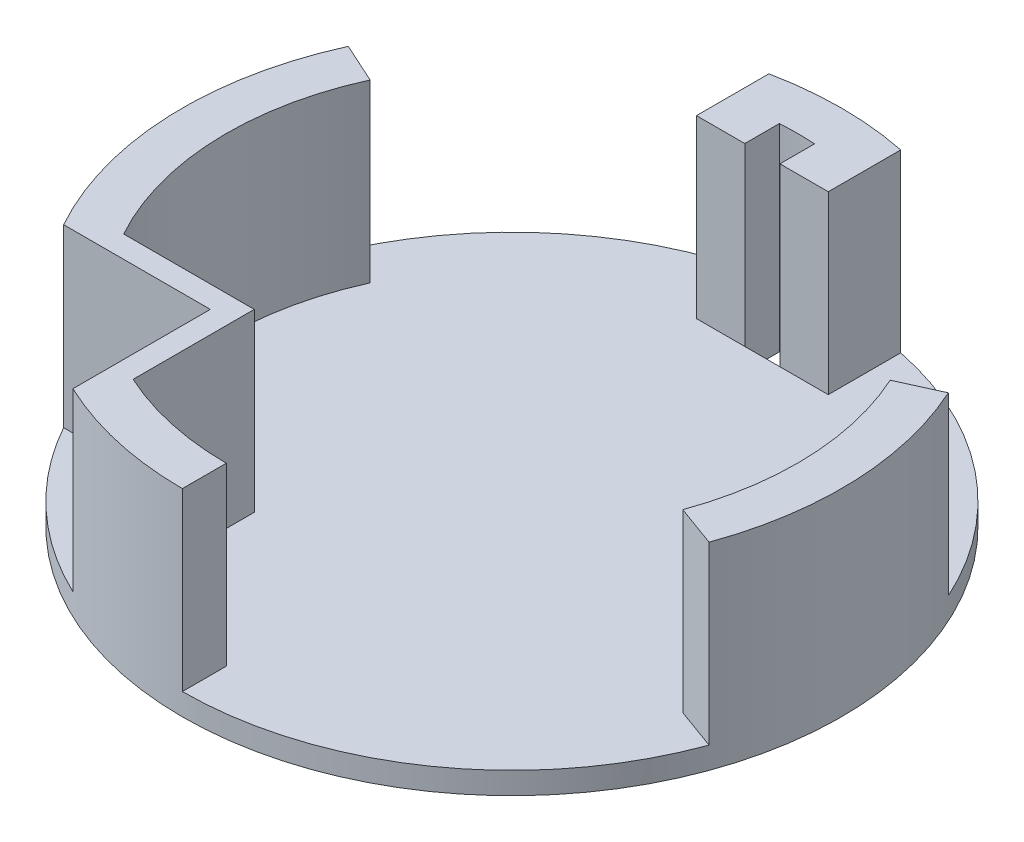
ISO-10303-21;
HEADER;
FILE_DESCRIPTION(('STEP AP214'),'2;1');
FILE_NAME('part.step','',(''),(''),'','','');
FILE_SCHEMA(('AUTOMOTIVE_DESIGN { 1 0 10303 214 1 1 1 1 }'));
ENDSEC;
DATA;
#1=APPLICATION_CONTEXT('core data for automotive mechanical design processes');
#2=APPLICATION_PROTOCOL_DEFINITION('international standard','automotive_design',2000,#1);
#3=PRODUCT_CONTEXT('',#1,'mechanical');
#4=PRODUCT('Part','Part','',(#3));
#5=PRODUCT_RELATED_PRODUCT_CATEGORY('part','',(#4));
#6=PRODUCT_DEFINITION_FORMATION('','',#4);
#7=PRODUCT_DEFINITION_CONTEXT('part definition',#1,'design');
#8=PRODUCT_DEFINITION('design','',#6,#7);
#9=PRODUCT_DEFINITION_SHAPE('','',#8);
#10=(LENGTH_UNIT() NAMED_UNIT(*) SI_UNIT(.MILLI.,.METRE.));
#11=(NAMED_UNIT(*) PLANE_ANGLE_UNIT() SI_UNIT($,.RADIAN.));
#12=(NAMED_UNIT(*) SI_UNIT($,.STERADIAN.) SOLID_ANGLE_UNIT());
#13=UNCERTAINTY_MEASURE_WITH_UNIT(LENGTH_MEASURE(1.E-05),#10,'distance_accuracy_value','');
#14=(GEOMETRIC_REPRESENTATION_CONTEXT(3) GLOBAL_UNCERTAINTY_ASSIGNED_CONTEXT((#13)) GLOBAL_UNIT_ASSIGNED_CONTEXT((#10,
#11,#12)) REPRESENTATION_CONTEXT('',''));
#15=CARTESIAN_POINT('',(0.,0.,0.));
#16=DIRECTION('',(0.,0.,1.));
#17=DIRECTION('',(1.,0.,0.));
#18=AXIS2_PLACEMENT_3D('',#15,#16,#17);
#19=CARTESIAN_POINT('',(-5.93581678931924,5.,0.));
#20=DIRECTION('',(0.,1.,0.));
#21=DIRECTION('',(0.,0.,1.));
#22=AXIS2_PLACEMENT_3D('',#19,#20,#21);
#23=PLANE('',#22);
#24=DIRECTION('',(0.,0.,-1.));
#25=VECTOR('',#24,1.);
#26=CARTESIAN_POINT('',(9.05109394839178,5.,0.));
#27=LINE('',#26,#25);
#28=CARTESIAN_POINT('',(9.05109394839178,5.,-56.9999985956657));
#29=VERTEX_POINT('',#28);
#30=CARTESIAN_POINT('',(9.05109394839178,5.,-73.4873629036985));
#31=VERTEX_POINT('',#30);
#32=EDGE_CURVE('E249',#29,#31,#27,.T.);
#33=ORIENTED_EDGE('',*,*,#32,.F.);
#34=DIRECTION('',(1.,0.,0.));
#35=VECTOR('',#34,1.);
#36=CARTESIAN_POINT('',(0.,5.,-56.9999985956657));
#37=LINE('',#36,#35);
#38=CARTESIAN_POINT('',(-1.94890605160822,5.,-56.9999985956657));
#39=VERTEX_POINT('',#38);
#40=EDGE_CURVE('E246',#39,#29,#37,.T.);
#41=ORIENTED_EDGE('',*,*,#40,.F.);
#42=DIRECTION('',(1.,0.,0.));
#43=VECTOR('',#42,1.);
#44=CARTESIAN_POINT('',(0.,5.,-56.9999985956657));
#45=LINE('',#44,#43);
#46=CARTESIAN_POINT('',(-9.94890605160822,5.,-56.9999985956657));
#47=VERTEX_POINT('',#46);
#48=EDGE_CURVE('E415',#47,#39,#45,.T.);
#49=ORIENTED_EDGE('',*,*,#48,.F.);
#50=DIRECTION('',(1.,0.,0.));
#51=VECTOR('',#50,1.);
#52=CARTESIAN_POINT('',(0.,5.,-56.9999985956657));
#53=LINE('',#52,#51);
#54=CARTESIAN_POINT('',(-20.9489060516082,5.,-56.9999985956657));
#55=VERTEX_POINT('',#54);
#56=EDGE_CURVE('E219',#55,#47,#53,.T.);
#57=ORIENTED_EDGE('',*,*,#56,.F.);
#58=DIRECTION('',(0.,0.,-1.));
#59=VECTOR('',#58,1.);
#60=CARTESIAN_POINT('',(-20.9489060516082,5.,0.));
#61=LINE('',#60,#59);
#62=CARTESIAN_POINT('',(-20.9489060516082,5.,-73.4820192346573));
#63=VERTEX_POINT('',#62);
#64=EDGE_CURVE('E252',#55,#63,#61,.T.);
#65=ORIENTED_EDGE('',*,*,#64,.T.);
#66=CARTESIAN_POINT('',(-5.93581678931924,5.,0.));
#67=DIRECTION('',(0.,1.,0.));
#68=DIRECTION('',(0.,0.,1.));
#69=AXIS2_PLACEMENT_3D('',#66,#67,#68);
#70=CIRCLE('',#69,75.);
#71=CARTESIAN_POINT('',(-74.2133025990146,5.,-31.0352208225888));
#72=VERTEX_POINT('',#71);
#73=EDGE_CURVE('E434',#63,#72,#70,.T.);
#74=ORIENTED_EDGE('',*,*,#73,.T.);
#75=DIRECTION('',(-0.910366477462605,0.,-0.413802944301184));
#76=VECTOR('',#75,1.);
#77=CARTESIAN_POINT('',(-1.01640698447247,5.,2.23609536583944));
#78=LINE('',#77,#76);
#79=CARTESIAN_POINT('',(-65.1096378243886,5.,-26.897191379577));
#80=VERTEX_POINT('',#79);
#81=EDGE_CURVE('E65',#80,#72,#78,.T.);
#82=ORIENTED_EDGE('',*,*,#81,.F.);
#83=CARTESIAN_POINT('',(-5.93581678931925,5.,0.));
#84=DIRECTION('',(0.,1.,0.));
#85=DIRECTION('',(0.,0.,1.));
#86=AXIS2_PLACEMENT_3D('',#83,#84,#85);
#87=CIRCLE('',#86,65.);
#88=CARTESIAN_POINT('',(-62.7930942478822,5.,31.4999999999999));
#89=VERTEX_POINT('',#88);
#90=EDGE_CURVE('E325',#80,#89,#87,.T.);
#91=ORIENTED_EDGE('',*,*,#90,.T.);
#92=DIRECTION('',(-1.,0.,0.));
#93=VECTOR('',#92,1.);
#94=CARTESIAN_POINT('',(0.,5.,31.4999999999999));
#95=LINE('',#94,#93);
#96=CARTESIAN_POINT('',(-33.0722447177623,5.,31.4999999999999));
#97=VERTEX_POINT('',#96);
#98=EDGE_CURVE('E321',#97,#89,#95,.T.);
#99=ORIENTED_EDGE('',*,*,#98,.F.);
#100=DIRECTION('',(0.,0.,1.));
#101=VECTOR('',#100,1.);
#102=CARTESIAN_POINT('',(-33.0722447177623,5.,0.));
#103=LINE('',#102,#101);
#104=CARTESIAN_POINT('',(-33.0722447177623,5.,59.0644925423424));
#105=VERTEX_POINT('',#104);
#106=EDGE_CURVE('E318',#97,#105,#103,.T.);
#107=ORIENTED_EDGE('',*,*,#106,.T.);
#108=CARTESIAN_POINT('',(-5.93581678931925,5.,0.));
#109=DIRECTION('',(0.,1.,0.));
#110=DIRECTION('',(0.,0.,1.));
#111=AXIS2_PLACEMENT_3D('',#108,#109,#110);
#112=CIRCLE('',#111,65.);
#113=CARTESIAN_POINT('',(-5.93581678931924,5.,65.));
#114=VERTEX_POINT('',#113);
#115=EDGE_CURVE('E278',#105,#114,#112,.T.);
#116=ORIENTED_EDGE('',*,*,#115,.T.);
#117=DIRECTION('',(0.,0.,1.));
#118=VECTOR('',#117,1.);
#119=CARTESIAN_POINT('',(-5.93581678931925,5.,0.));
#120=LINE('',#119,#118);
#121=CARTESIAN_POINT('',(-5.93581678931924,5.,75.));
#122=VERTEX_POINT('',#121);
#123=EDGE_CURVE('E284',#114,#122,#120,.T.);
#124=ORIENTED_EDGE('',*,*,#123,.T.);
#125=CARTESIAN_POINT('',(64.5486899723135,5.,25.6307297315028));
#126=VERTEX_POINT('',#125);
#127=EDGE_CURVE('E439',#122,#126,#70,.T.);
#128=ORIENTED_EDGE('',*,*,#127,.T.);
#129=DIRECTION('',(0.939793423488437,0.,0.341743063086705));
#130=VECTOR('',#129,1.);
#131=CARTESIAN_POINT('',(-0.693234077584731,5.,1.90639371335801));
#132=LINE('',#131,#130);
#133=CARTESIAN_POINT('',(55.1507557374292,5.,22.2132991006358));
#134=VERTEX_POINT('',#133);
#135=EDGE_CURVE('E394',#134,#126,#132,.T.);
#136=ORIENTED_EDGE('',*,*,#135,.F.);
#137=CARTESIAN_POINT('',(-5.93581678931925,5.,0.));
#138=DIRECTION('',(0.,1.,0.));
#139=DIRECTION('',(0.,0.,1.));
#140=AXIS2_PLACEMENT_3D('',#137,#138,#139);
#141=CIRCLE('',#140,65.);
#142=CARTESIAN_POINT('',(53.2380042457501,5.,-26.897191379577));
#143=VERTEX_POINT('',#142);
#144=EDGE_CURVE('E375',#134,#143,#141,.T.);
#145=ORIENTED_EDGE('',*,*,#144,.T.);
#146=DIRECTION('',(0.910366477462605,0.,-0.413802944301184));
#147=VECTOR('',#146,1.);
#148=CARTESIAN_POINT('',(-1.01640698447247,5.,-2.23609536583944));
#149=LINE('',#148,#147);
#150=CARTESIAN_POINT('',(62.3416690203761,5.,-31.0352208225888));
#151=VERTEX_POINT('',#150);
#152=EDGE_CURVE('E381',#143,#151,#149,.T.);
#153=ORIENTED_EDGE('',*,*,#152,.T.);
#154=EDGE_CURVE('E429',#151,#31,#70,.T.);
#155=ORIENTED_EDGE('',*,*,#154,.T.);
#156=EDGE_LOOP('',(#33,#41,#49,#57,#65,#74,#82,#91,#99,#107,#116,#124,#128,#136,#145,#153,#155));
#157=FACE_BOUND('',#156,.T.);
#158=ADVANCED_FACE('F41',(#157),#23,.T.);
#159=DIRECTION('',(-1.,0.,0.));
#160=VECTOR('',#159,1.);
#161=CARTESIAN_POINT('',(0.,5.,36.4999999999999));
#162=LINE('',#161,#160);
#163=CARTESIAN_POINT('',(-38.0722447177622,5.,36.4999999999999));
#164=VERTEX_POINT('',#163);
#165=CARTESIAN_POINT('',(-71.4548979794581,5.,36.4999999999999));
#166=VERTEX_POINT('',#165);
#167=EDGE_CURVE('E330',#164,#166,#162,.T.);
#168=ORIENTED_EDGE('',*,*,#167,.T.);
#169=CARTESIAN_POINT('',(-38.0722447177622,5.,67.766141988459));
#170=VERTEX_POINT('',#169);
#171=EDGE_CURVE('E435',#166,#170,#70,.T.);
#172=ORIENTED_EDGE('',*,*,#171,.T.);
#173=DIRECTION('',(0.,0.,1.));
#174=VECTOR('',#173,1.);
#175=CARTESIAN_POINT('',(-38.0722447177622,5.,0.));
#176=LINE('',#175,#174);
#177=EDGE_CURVE('E57',#164,#170,#176,.T.);
#178=ORIENTED_EDGE('',*,*,#177,.F.);
#179=EDGE_LOOP('',(#168,#172,#178));
#180=FACE_BOUND('',#179,.T.);
#181=ADVANCED_FACE('F486',(#180),#23,.T.);
#182=CARTESIAN_POINT('',(-5.93581678931924,0.,0.));
#183=DIRECTION('',(0.,1.,0.));
#184=DIRECTION('',(0.,0.,1.));
#185=AXIS2_PLACEMENT_3D('',#182,#183,#184);
#186=PLANE('',#185);
#187=CARTESIAN_POINT('',(-5.93581678931924,0.,0.));
#188=DIRECTION('',(0.,1.,0.));
#189=DIRECTION('',(0.,0.,1.));
#190=AXIS2_PLACEMENT_3D('',#187,#188,#189);
#191=CIRCLE('',#190,75.);
#192=CARTESIAN_POINT('',(-5.93581678931924,0.,75.));
#193=VERTEX_POINT('',#192);
#194=EDGE_CURVE('E423',#193,#193,#191,.T.);
#195=ORIENTED_EDGE('',*,*,#194,.F.);
#196=EDGE_LOOP('',(#195));
#197=FACE_BOUND('',#196,.T.);
#198=DIRECTION('',(0.,0.,1.));
#199=VECTOR('',#198,1.);
#200=CARTESIAN_POINT('',(-1.94890605160821,0.,0.));
#201=LINE('',#200,#199);
#202=CARTESIAN_POINT('',(-1.94890605160822,0.,-64.8776120304187));
#203=VERTEX_POINT('',#202);
#204=CARTESIAN_POINT('',(-1.94890605160822,0.,-56.9999985956657));
#205=VERTEX_POINT('',#204);
#206=EDGE_CURVE('E11',#203,#205,#201,.T.);
#207=ORIENTED_EDGE('',*,*,#206,.F.);
#208=CARTESIAN_POINT('',(-5.93581678931925,0.,0.));
#209=DIRECTION('',(0.,1.,0.));
#210=DIRECTION('',(0.,0.,1.));
#211=AXIS2_PLACEMENT_3D('',#208,#209,#210);
#212=CIRCLE('',#211,65.);
#213=CARTESIAN_POINT('',(-9.94890605160822,0.,-64.8759979851786));
#214=VERTEX_POINT('',#213);
#215=EDGE_CURVE('E433',#203,#214,#212,.T.);
#216=ORIENTED_EDGE('',*,*,#215,.T.);
#217=DIRECTION('',(0.,0.,1.));
#218=VECTOR('',#217,1.);
#219=CARTESIAN_POINT('',(-9.94890605160819,0.,0.));
#220=LINE('',#219,#218);
#221=CARTESIAN_POINT('',(-9.94890605160822,0.,-56.9999985956657));
#222=VERTEX_POINT('',#221);
#223=EDGE_CURVE('E202',#214,#222,#220,.T.);
#224=ORIENTED_EDGE('',*,*,#223,.T.);
#225=DIRECTION('',(1.,0.,0.));
#226=VECTOR('',#225,1.);
#227=CARTESIAN_POINT('',(-5.93581678931924,0.,-56.9999985956657));
#228=LINE('',#227,#226);
#229=EDGE_CURVE('E50',#222,#205,#228,.T.);
#230=ORIENTED_EDGE('',*,*,#229,.T.);
#231=EDGE_LOOP('',(#207,#216,#224,#230));
#232=FACE_BOUND('',#231,.T.);
#233=ADVANCED_FACE('F447',(#197,#232),#186,.F.);
#234=CARTESIAN_POINT('',(-5.93581678931924,5.,0.));
#235=DIRECTION('',(0.,-1.,0.));
#236=DIRECTION('',(0.,0.,-1.));
#237=AXIS2_PLACEMENT_3D('',#234,#235,#236);
#238=CYLINDRICAL_SURFACE('',#237,75.);
#239=ORIENTED_EDGE('',*,*,#154,.F.);
#240=DIRECTION('',(0.,-1.,0.));
#241=VECTOR('',#240,1.);
#242=CARTESIAN_POINT('',(62.3416690203761,45.,-31.0352208225888));
#243=LINE('',#242,#241);
#244=CARTESIAN_POINT('',(62.3416690203761,45.,-31.0352208225888));
#245=VERTEX_POINT('',#244);
#246=EDGE_CURVE('E403',#245,#151,#243,.T.);
#247=ORIENTED_EDGE('',*,*,#246,.F.);
#248=CARTESIAN_POINT('',(-5.93581678931924,45.,0.));
#249=DIRECTION('',(0.,1.,0.));
#250=DIRECTION('',(0.,0.,1.));
#251=AXIS2_PLACEMENT_3D('',#248,#249,#250);
#252=CIRCLE('',#251,75.);
#253=CARTESIAN_POINT('',(64.5486899723135,45.,25.6307297315028));
#254=VERTEX_POINT('',#253);
#255=EDGE_CURVE('E384',#254,#245,#252,.T.);
#256=ORIENTED_EDGE('',*,*,#255,.F.);
#257=DIRECTION('',(0.,-1.,0.));
#258=VECTOR('',#257,1.);
#259=CARTESIAN_POINT('',(64.5486899723135,45.,25.6307297315028));
#260=LINE('',#259,#258);
#261=EDGE_CURVE('E407',#254,#126,#260,.T.);
#262=ORIENTED_EDGE('',*,*,#261,.T.);
#263=ORIENTED_EDGE('',*,*,#127,.F.);
#264=DIRECTION('',(0.,-1.,0.));
#265=VECTOR('',#264,1.);
#266=CARTESIAN_POINT('',(-5.93581678931924,45.,75.));
#267=LINE('',#266,#265);
#268=CARTESIAN_POINT('',(-5.93581678931924,45.,75.));
#269=VERTEX_POINT('',#268);
#270=EDGE_CURVE('E341',#269,#122,#267,.T.);
#271=ORIENTED_EDGE('',*,*,#270,.F.);
#272=CARTESIAN_POINT('',(-5.93581678931924,45.,0.));
#273=DIRECTION('',(0.,1.,0.));
#274=DIRECTION('',(0.,0.,1.));
#275=AXIS2_PLACEMENT_3D('',#272,#273,#274);
#276=CIRCLE('',#275,75.);
#277=CARTESIAN_POINT('',(-38.0722447177622,45.,67.766141988459));
#278=VERTEX_POINT('',#277);
#279=EDGE_CURVE('E308',#278,#269,#276,.T.);
#280=ORIENTED_EDGE('',*,*,#279,.F.);
#281=DIRECTION('',(0.,-1.,0.));
#282=VECTOR('',#281,1.);
#283=CARTESIAN_POINT('',(-38.0722447177622,45.,67.766141988459));
#284=LINE('',#283,#282);
#285=EDGE_CURVE('E345',#278,#170,#284,.T.);
#286=ORIENTED_EDGE('',*,*,#285,.T.);
#287=ORIENTED_EDGE('',*,*,#171,.F.);
#288=DIRECTION('',(0.,-1.,0.));
#289=VECTOR('',#288,1.);
#290=CARTESIAN_POINT('',(-71.4548979794581,45.,36.4999999999999));
#291=LINE('',#290,#289);
#292=CARTESIAN_POINT('',(-71.4548979794581,45.,36.4999999999999));
#293=VERTEX_POINT('',#292);
#294=EDGE_CURVE('E352',#293,#166,#291,.T.);
#295=ORIENTED_EDGE('',*,*,#294,.F.);
#296=CARTESIAN_POINT('',(-5.93581678931924,45.,0.));
#297=DIRECTION('',(0.,1.,0.));
#298=DIRECTION('',(0.,0.,1.));
#299=AXIS2_PLACEMENT_3D('',#296,#297,#298);
#300=CIRCLE('',#299,75.);
#301=CARTESIAN_POINT('',(-74.2133025990146,45.,-31.0352208225888));
#302=VERTEX_POINT('',#301);
#303=EDGE_CURVE('E298',#302,#293,#300,.T.);
#304=ORIENTED_EDGE('',*,*,#303,.F.);
#305=DIRECTION('',(0.,-1.,0.));
#306=VECTOR('',#305,1.);
#307=CARTESIAN_POINT('',(-74.2133025990146,45.,-31.0352208225888));
#308=LINE('',#307,#306);
#309=EDGE_CURVE('E356',#302,#72,#308,.T.);
#310=ORIENTED_EDGE('',*,*,#309,.T.);
#311=ORIENTED_EDGE('',*,*,#73,.F.);
#312=DIRECTION('',(0.,-1.,0.));
#313=VECTOR('',#312,1.);
#314=CARTESIAN_POINT('',(-20.9489060516082,45.,-73.4820192346573));
#315=LINE('',#314,#313);
#316=CARTESIAN_POINT('',(-20.9489060516082,45.,-73.4820192346573));
#317=VERTEX_POINT('',#316);
#318=EDGE_CURVE('E264',#317,#63,#315,.T.);
#319=ORIENTED_EDGE('',*,*,#318,.F.);
#320=CARTESIAN_POINT('',(-5.93581678931924,45.,0.));
#321=DIRECTION('',(0.,1.,0.));
#322=DIRECTION('',(0.,0.,1.));
#323=AXIS2_PLACEMENT_3D('',#320,#321,#322);
#324=CIRCLE('',#323,75.);
#325=CARTESIAN_POINT('',(9.05109394839178,45.,-73.4873629036985));
#326=VERTEX_POINT('',#325);
#327=EDGE_CURVE('E236',#326,#317,#324,.T.);
#328=ORIENTED_EDGE('',*,*,#327,.F.);
#329=DIRECTION('',(0.,-1.,0.));
#330=VECTOR('',#329,1.);
#331=CARTESIAN_POINT('',(9.05109394839178,45.,-73.4873629036985));
#332=LINE('',#331,#330);
#333=EDGE_CURVE('E267',#326,#31,#332,.T.);
#334=ORIENTED_EDGE('',*,*,#333,.T.);
#335=EDGE_LOOP('',(#239,#247,#256,#262,#263,#271,#280,#286,#287,#295,#304,#310,#311,#319,#328,#334));
#336=FACE_BOUND('',#335,.T.);
#337=ORIENTED_EDGE('',*,*,#194,.T.);
#338=EDGE_LOOP('',(#337));
#339=FACE_BOUND('',#338,.T.);
#340=ADVANCED_FACE('F43',(#336,#339),#238,.T.);
#341=CARTESIAN_POINT('',(-1.94890605160821,-5.,0.));
#342=DIRECTION('',(-1.,0.,0.));
#343=DIRECTION('',(0.,0.,1.));
#344=AXIS2_PLACEMENT_3D('',#341,#342,#343);
#345=PLANE('',#344);
#346=ORIENTED_EDGE('',*,*,#206,.T.);
#347=DIRECTION('',(0.,1.,0.));
#348=VECTOR('',#347,1.);
#349=CARTESIAN_POINT('',(-1.94890605160822,-5.,-56.9999985956657));
#350=LINE('',#349,#348);
#351=EDGE_CURVE('E419',#205,#39,#350,.T.);
#352=ORIENTED_EDGE('',*,*,#351,.T.);
#353=DIRECTION('',(0.,-1.,0.));
#354=VECTOR('',#353,1.);
#355=CARTESIAN_POINT('',(-1.94890605160822,45.,-56.9999985956657));
#356=LINE('',#355,#354);
#357=CARTESIAN_POINT('',(-1.94890605160822,45.,-56.9999985956657));
#358=VERTEX_POINT('',#357);
#359=EDGE_CURVE('E275',#358,#39,#356,.T.);
#360=ORIENTED_EDGE('',*,*,#359,.F.);
#361=DIRECTION('',(0.,0.,1.));
#362=VECTOR('',#361,1.);
#363=CARTESIAN_POINT('',(-1.94890605160821,45.,0.));
#364=LINE('',#363,#362);
#365=CARTESIAN_POINT('',(-1.94890605160822,45.,-64.8776120304187));
#366=VERTEX_POINT('',#365);
#367=EDGE_CURVE('E225',#366,#358,#364,.T.);
#368=ORIENTED_EDGE('',*,*,#367,.F.);
#369=DIRECTION('',(0.,1.,0.));
#370=VECTOR('',#369,1.);
#371=CARTESIAN_POINT('',(-1.94890605160822,-5.,-64.8776120304187));
#372=LINE('',#371,#370);
#373=EDGE_CURVE('E208',#203,#366,#372,.T.);
#374=ORIENTED_EDGE('',*,*,#373,.F.);
#375=EDGE_LOOP('',(#346,#352,#360,#368,#374));
#376=FACE_BOUND('',#375,.T.);
#377=ADVANCED_FACE('F463',(#376),#345,.T.);
#378=CARTESIAN_POINT('',(0.,-5.,-56.9999985956657));
#379=DIRECTION('',(0.,0.,1.));
#380=DIRECTION('',(1.,0.,0.));
#381=AXIS2_PLACEMENT_3D('',#378,#379,#380);
#382=PLANE('',#381);
#383=DIRECTION('',(0.,1.,0.));
#384=VECTOR('',#383,1.);
#385=CARTESIAN_POINT('',(-9.94890605160822,-5.,-56.9999985956657));
#386=LINE('',#385,#384);
#387=EDGE_CURVE('E207',#222,#47,#386,.T.);
#388=ORIENTED_EDGE('',*,*,#387,.T.);
#389=ORIENTED_EDGE('',*,*,#48,.T.);
#390=ORIENTED_EDGE('',*,*,#351,.F.);
#391=ORIENTED_EDGE('',*,*,#229,.F.);
#392=EDGE_LOOP('',(#388,#389,#390,#391));
#393=FACE_BOUND('',#392,.T.);
#394=ADVANCED_FACE('F450',(#393),#382,.F.);
#395=CARTESIAN_POINT('',(-9.94890605160819,-5.,0.));
#396=DIRECTION('',(-1.,0.,0.));
#397=DIRECTION('',(0.,0.,1.));
#398=AXIS2_PLACEMENT_3D('',#395,#396,#397);
#399=PLANE('',#398);
#400=DIRECTION('',(0.,1.,0.));
#401=VECTOR('',#400,1.);
#402=CARTESIAN_POINT('',(-9.94890605160822,-5.,-64.8759979851786));
#403=LINE('',#402,#401);
#404=CARTESIAN_POINT('',(-9.94890605160822,45.,-64.8759979851786));
#405=VERTEX_POINT('',#404);
#406=EDGE_CURVE('E196',#214,#405,#403,.T.);
#407=ORIENTED_EDGE('',*,*,#406,.T.);
#408=DIRECTION('',(0.,0.,1.));
#409=VECTOR('',#408,1.);
#410=CARTESIAN_POINT('',(-9.94890605160819,45.,0.));
#411=LINE('',#410,#409);
#412=CARTESIAN_POINT('',(-9.94890605160822,45.,-56.9999985956657));
#413=VERTEX_POINT('',#412);
#414=EDGE_CURVE('E199',#405,#413,#411,.T.);
#415=ORIENTED_EDGE('',*,*,#414,.T.);
#416=DIRECTION('',(0.,-1.,0.));
#417=VECTOR('',#416,1.);
#418=CARTESIAN_POINT('',(-9.94890605160822,45.,-56.9999985956657));
#419=LINE('',#418,#417);
#420=EDGE_CURVE('E245',#413,#47,#419,.T.);
#421=ORIENTED_EDGE('',*,*,#420,.T.);
#422=ORIENTED_EDGE('',*,*,#387,.F.);
#423=ORIENTED_EDGE('',*,*,#223,.F.);
#424=EDGE_LOOP('',(#407,#415,#421,#422,#423));
#425=FACE_BOUND('',#424,.T.);
#426=ADVANCED_FACE('F198',(#425),#399,.F.);
#427=CARTESIAN_POINT('',(-5.93581678931925,-5.,0.));
#428=DIRECTION('',(0.,1.,0.));
#429=DIRECTION('',(0.,0.,1.));
#430=AXIS2_PLACEMENT_3D('',#427,#428,#429);
#431=CYLINDRICAL_SURFACE('',#430,65.);
#432=ORIENTED_EDGE('',*,*,#373,.T.);
#433=CARTESIAN_POINT('',(-5.93581678931925,45.,0.));
#434=DIRECTION('',(0.,1.,0.));
#435=DIRECTION('',(0.,0.,1.));
#436=AXIS2_PLACEMENT_3D('',#433,#434,#435);
#437=CIRCLE('',#436,65.);
#438=EDGE_CURVE('E213',#366,#405,#437,.T.);
#439=ORIENTED_EDGE('',*,*,#438,.T.);
#440=ORIENTED_EDGE('',*,*,#406,.F.);
#441=ORIENTED_EDGE('',*,*,#215,.F.);
#442=EDGE_LOOP('',(#432,#439,#440,#441));
#443=FACE_BOUND('',#442,.T.);
#444=ADVANCED_FACE('F221',(#443),#431,.F.);
#445=CARTESIAN_POINT('',(-5.93581678931925,45.,0.));
#446=DIRECTION('',(0.,-1.,0.));
#447=DIRECTION('',(0.,0.,-1.));
#448=AXIS2_PLACEMENT_3D('',#445,#446,#447);
#449=CYLINDRICAL_SURFACE('',#448,65.);
#450=ORIENTED_EDGE('',*,*,#144,.F.);
#451=DIRECTION('',(0.,-1.,0.));
#452=VECTOR('',#451,1.);
#453=CARTESIAN_POINT('',(55.1507557374292,45.,22.2132991006358));
#454=LINE('',#453,#452);
#455=CARTESIAN_POINT('',(55.1507557374292,45.,22.2132991006358));
#456=VERTEX_POINT('',#455);
#457=EDGE_CURVE('E411',#456,#134,#454,.T.);
#458=ORIENTED_EDGE('',*,*,#457,.F.);
#459=CARTESIAN_POINT('',(-5.93581678931925,45.,0.));
#460=DIRECTION('',(0.,1.,0.));
#461=DIRECTION('',(0.,0.,1.));
#462=AXIS2_PLACEMENT_3D('',#459,#460,#461);
#463=CIRCLE('',#462,65.);
#464=CARTESIAN_POINT('',(53.2380042457501,45.,-26.897191379577));
#465=VERTEX_POINT('',#464);
#466=EDGE_CURVE('E376',#456,#465,#463,.T.);
#467=ORIENTED_EDGE('',*,*,#466,.T.);
#468=DIRECTION('',(0.,-1.,0.));
#469=VECTOR('',#468,1.);
#470=CARTESIAN_POINT('',(53.2380042457501,45.,-26.897191379577));
#471=LINE('',#470,#469);
#472=EDGE_CURVE('E391',#465,#143,#471,.T.);
#473=ORIENTED_EDGE('',*,*,#472,.T.);
#474=EDGE_LOOP('',(#450,#458,#467,#473));
#475=FACE_BOUND('',#474,.T.);
#476=ADVANCED_FACE('F511',(#475),#449,.F.);
#477=CARTESIAN_POINT('',(-0.693234077584731,45.,1.90639371335801));
#478=DIRECTION('',(0.341743063086705,0.,-0.939793423488437));
#479=DIRECTION('',(-0.939793423488437,0.,-0.341743063086705));
#480=AXIS2_PLACEMENT_3D('',#477,#478,#479);
#481=PLANE('',#480);
#482=ORIENTED_EDGE('',*,*,#135,.T.);
#483=ORIENTED_EDGE('',*,*,#261,.F.);
#484=DIRECTION('',(0.939793423488437,0.,0.341743063086705));
#485=VECTOR('',#484,1.);
#486=CARTESIAN_POINT('',(-0.693234077584731,45.,1.90639371335801));
#487=LINE('',#486,#485);
#488=EDGE_CURVE('E380',#456,#254,#487,.T.);
#489=ORIENTED_EDGE('',*,*,#488,.F.);
#490=ORIENTED_EDGE('',*,*,#457,.T.);
#491=EDGE_LOOP('',(#482,#483,#489,#490));
#492=FACE_BOUND('',#491,.T.);
#493=ADVANCED_FACE('F517',(#492),#481,.F.);
#494=CARTESIAN_POINT('',(-1.01640698447247,45.,-2.23609536583944));
#495=DIRECTION('',(-0.413802944301184,0.,-0.910366477462605));
#496=DIRECTION('',(-0.910366477462605,0.,0.413802944301184));
#497=AXIS2_PLACEMENT_3D('',#494,#495,#496);
#498=PLANE('',#497);
#499=ORIENTED_EDGE('',*,*,#152,.F.);
#500=ORIENTED_EDGE('',*,*,#472,.F.);
#501=DIRECTION('',(0.910366477462605,0.,-0.413802944301184));
#502=VECTOR('',#501,1.);
#503=CARTESIAN_POINT('',(-1.01640698447247,45.,-2.23609536583944));
#504=LINE('',#503,#502);
#505=EDGE_CURVE('E387',#465,#245,#504,.T.);
#506=ORIENTED_EDGE('',*,*,#505,.T.);
#507=ORIENTED_EDGE('',*,*,#246,.T.);
#508=EDGE_LOOP('',(#499,#500,#506,#507));
#509=FACE_BOUND('',#508,.T.);
#510=ADVANCED_FACE('F522',(#509),#498,.T.);
#511=CARTESIAN_POINT('',(0.,45.,0.));
#512=DIRECTION('',(0.,1.,0.));
#513=DIRECTION('',(0.,0.,1.));
#514=AXIS2_PLACEMENT_3D('',#511,#512,#513);
#515=PLANE('',#514);
#516=ORIENTED_EDGE('',*,*,#466,.F.);
#517=ORIENTED_EDGE('',*,*,#488,.T.);
#518=ORIENTED_EDGE('',*,*,#255,.T.);
#519=ORIENTED_EDGE('',*,*,#505,.F.);
#520=EDGE_LOOP('',(#516,#517,#518,#519));
#521=FACE_BOUND('',#520,.T.);
#522=ADVANCED_FACE('F532',(#521),#515,.T.);
#523=CARTESIAN_POINT('',(-5.93581678931925,45.,0.));
#524=DIRECTION('',(0.,-1.,0.));
#525=DIRECTION('',(0.,0.,-1.));
#526=AXIS2_PLACEMENT_3D('',#523,#524,#525);
#527=CYLINDRICAL_SURFACE('',#526,65.);
#528=ORIENTED_EDGE('',*,*,#115,.F.);
#529=DIRECTION('',(0.,-1.,0.));
#530=VECTOR('',#529,1.);
#531=CARTESIAN_POINT('',(-33.0722447177623,45.,59.0644925423424));
#532=LINE('',#531,#530);
#533=CARTESIAN_POINT('',(-33.0722447177623,45.,59.0644925423424));
#534=VERTEX_POINT('',#533);
#535=EDGE_CURVE('E371',#534,#105,#532,.T.);
#536=ORIENTED_EDGE('',*,*,#535,.F.);
#537=CARTESIAN_POINT('',(-5.93581678931925,45.,0.));
#538=DIRECTION('',(0.,1.,0.));
#539=DIRECTION('',(0.,0.,1.));
#540=AXIS2_PLACEMENT_3D('',#537,#538,#539);
#541=CIRCLE('',#540,65.);
#542=CARTESIAN_POINT('',(-5.93581678931924,45.,65.));
#543=VERTEX_POINT('',#542);
#544=EDGE_CURVE('E279',#534,#543,#541,.T.);
#545=ORIENTED_EDGE('',*,*,#544,.T.);
#546=DIRECTION('',(0.,-1.,0.));
#547=VECTOR('',#546,1.);
#548=CARTESIAN_POINT('',(-5.93581678931924,45.,65.));
#549=LINE('',#548,#547);
#550=EDGE_CURVE('E315',#543,#114,#549,.T.);
#551=ORIENTED_EDGE('',*,*,#550,.T.);
#552=EDGE_LOOP('',(#528,#536,#545,#551));
#553=FACE_BOUND('',#552,.T.);
#554=ADVANCED_FACE('F576',(#553),#527,.F.);
#555=CARTESIAN_POINT('',(-33.0722447177623,45.,0.));
#556=DIRECTION('',(1.,0.,0.));
#557=DIRECTION('',(0.,0.,-1.));
#558=AXIS2_PLACEMENT_3D('',#555,#556,#557);
#559=PLANE('',#558);
#560=ORIENTED_EDGE('',*,*,#106,.F.);
#561=DIRECTION('',(0.,-1.,0.));
#562=VECTOR('',#561,1.);
#563=CARTESIAN_POINT('',(-33.0722447177623,45.,31.4999999999999));
#564=LINE('',#563,#562);
#565=CARTESIAN_POINT('',(-33.0722447177623,45.,31.4999999999999));
#566=VERTEX_POINT('',#565);
#567=EDGE_CURVE('E367',#566,#97,#564,.T.);
#568=ORIENTED_EDGE('',*,*,#567,.F.);
#569=DIRECTION('',(0.,0.,1.));
#570=VECTOR('',#569,1.);
#571=CARTESIAN_POINT('',(-33.0722447177623,45.,0.));
#572=LINE('',#571,#570);
#573=EDGE_CURVE('E283',#566,#534,#572,.T.);
#574=ORIENTED_EDGE('',*,*,#573,.T.);
#575=ORIENTED_EDGE('',*,*,#535,.T.);
#576=EDGE_LOOP('',(#560,#568,#574,#575));
#577=FACE_BOUND('',#576,.T.);
#578=ADVANCED_FACE('F574',(#577),#559,.T.);
#579=CARTESIAN_POINT('',(0.,45.,31.4999999999999));
#580=DIRECTION('',(0.,0.,1.));
#581=DIRECTION('',(1.,0.,0.));
#582=AXIS2_PLACEMENT_3D('',#579,#580,#581);
#583=PLANE('',#582);
#584=ORIENTED_EDGE('',*,*,#98,.T.);
#585=DIRECTION('',(0.,-1.,0.));
#586=VECTOR('',#585,1.);
#587=CARTESIAN_POINT('',(-62.7930942478822,45.,31.4999999999999));
#588=LINE('',#587,#586);
#589=CARTESIAN_POINT('',(-62.7930942478822,45.,31.4999999999999));
#590=VERTEX_POINT('',#589);
#591=EDGE_CURVE('E363',#590,#89,#588,.T.);
#592=ORIENTED_EDGE('',*,*,#591,.F.);
#593=DIRECTION('',(-1.,0.,0.));
#594=VECTOR('',#593,1.);
#595=CARTESIAN_POINT('',(0.,45.,31.4999999999999));
#596=LINE('',#595,#594);
#597=EDGE_CURVE('E288',#566,#590,#596,.T.);
#598=ORIENTED_EDGE('',*,*,#597,.F.);
#599=ORIENTED_EDGE('',*,*,#567,.T.);
#600=EDGE_LOOP('',(#584,#592,#598,#599));
#601=FACE_BOUND('',#600,.T.);
#602=ADVANCED_FACE('F572',(#601),#583,.F.);
#603=CARTESIAN_POINT('',(-5.93581678931925,45.,0.));
#604=DIRECTION('',(0.,-1.,0.));
#605=DIRECTION('',(0.,0.,-1.));
#606=AXIS2_PLACEMENT_3D('',#603,#604,#605);
#607=CYLINDRICAL_SURFACE('',#606,65.);
#608=ORIENTED_EDGE('',*,*,#90,.F.);
#609=DIRECTION('',(0.,-1.,0.));
#610=VECTOR('',#609,1.);
#611=CARTESIAN_POINT('',(-65.1096378243886,45.,-26.897191379577));
#612=LINE('',#611,#610);
#613=CARTESIAN_POINT('',(-65.1096378243886,45.,-26.897191379577));
#614=VERTEX_POINT('',#613);
#615=EDGE_CURVE('E360',#614,#80,#612,.T.);
#616=ORIENTED_EDGE('',*,*,#615,.F.);
#617=CARTESIAN_POINT('',(-5.93581678931925,45.,0.));
#618=DIRECTION('',(0.,1.,0.));
#619=DIRECTION('',(0.,0.,1.));
#620=AXIS2_PLACEMENT_3D('',#617,#618,#619);
#621=CIRCLE('',#620,65.);
#622=EDGE_CURVE('E291',#614,#590,#621,.T.);
#623=ORIENTED_EDGE('',*,*,#622,.T.);
#624=ORIENTED_EDGE('',*,*,#591,.T.);
#625=EDGE_LOOP('',(#608,#616,#623,#624));
#626=FACE_BOUND('',#625,.T.);
#627=ADVANCED_FACE('F569',(#626),#607,.F.);
#628=CARTESIAN_POINT('',(-1.01640698447247,45.,2.23609536583944));
#629=DIRECTION('',(-0.413802944301184,0.,0.910366477462605));
#630=DIRECTION('',(0.910366477462605,0.,0.413802944301184));
#631=AXIS2_PLACEMENT_3D('',#628,#629,#630);
#632=PLANE('',#631);
#633=ORIENTED_EDGE('',*,*,#81,.T.);
#634=ORIENTED_EDGE('',*,*,#309,.F.);
#635=DIRECTION('',(-0.910366477462605,0.,-0.413802944301184));
#636=VECTOR('',#635,1.);
#637=CARTESIAN_POINT('',(-1.01640698447247,45.,2.23609536583944));
#638=LINE('',#637,#636);
#639=EDGE_CURVE('E295',#614,#302,#638,.T.);
#640=ORIENTED_EDGE('',*,*,#639,.F.);
#641=ORIENTED_EDGE('',*,*,#615,.T.);
#642=EDGE_LOOP('',(#633,#634,#640,#641));
#643=FACE_BOUND('',#642,.T.);
#644=ADVANCED_FACE('F561',(#643),#632,.F.);
#645=CARTESIAN_POINT('',(0.,45.,36.4999999999999));
#646=DIRECTION('',(0.,0.,1.));
#647=DIRECTION('',(1.,0.,0.));
#648=AXIS2_PLACEMENT_3D('',#645,#646,#647);
#649=PLANE('',#648);
#650=ORIENTED_EDGE('',*,*,#167,.F.);
#651=DIRECTION('',(0.,-1.,0.));
#652=VECTOR('',#651,1.);
#653=CARTESIAN_POINT('',(-38.0722447177622,45.,36.4999999999999));
#654=LINE('',#653,#652);
#655=CARTESIAN_POINT('',(-38.0722447177622,45.,36.4999999999999));
#656=VERTEX_POINT('',#655);
#657=EDGE_CURVE('E349',#656,#164,#654,.T.);
#658=ORIENTED_EDGE('',*,*,#657,.F.);
#659=DIRECTION('',(-1.,0.,0.));
#660=VECTOR('',#659,1.);
#661=CARTESIAN_POINT('',(0.,45.,36.4999999999999));
#662=LINE('',#661,#660);
#663=EDGE_CURVE('E301',#656,#293,#662,.T.);
#664=ORIENTED_EDGE('',*,*,#663,.T.);
#665=ORIENTED_EDGE('',*,*,#294,.T.);
#666=EDGE_LOOP('',(#650,#658,#664,#665));
#667=FACE_BOUND('',#666,.T.);
#668=ADVANCED_FACE('F556',(#667),#649,.T.);
#669=CARTESIAN_POINT('',(-38.0722447177622,45.,0.));
#670=DIRECTION('',(1.,0.,0.));
#671=DIRECTION('',(0.,0.,-1.));
#672=AXIS2_PLACEMENT_3D('',#669,#670,#671);
#673=PLANE('',#672);
#674=ORIENTED_EDGE('',*,*,#177,.T.);
#675=ORIENTED_EDGE('',*,*,#285,.F.);
#676=DIRECTION('',(0.,0.,1.));
#677=VECTOR('',#676,1.);
#678=CARTESIAN_POINT('',(-38.0722447177622,45.,0.));
#679=LINE('',#678,#677);
#680=EDGE_CURVE('E305',#656,#278,#679,.T.);
#681=ORIENTED_EDGE('',*,*,#680,.F.);
#682=ORIENTED_EDGE('',*,*,#657,.T.);
#683=EDGE_LOOP('',(#674,#675,#681,#682));
#684=FACE_BOUND('',#683,.T.);
#685=ADVANCED_FACE('F553',(#684),#673,.F.);
#686=CARTESIAN_POINT('',(-5.93581678931925,45.,0.));
#687=DIRECTION('',(1.,0.,0.));
#688=DIRECTION('',(0.,0.,-1.));
#689=AXIS2_PLACEMENT_3D('',#686,#687,#688);
#690=PLANE('',#689);
#691=ORIENTED_EDGE('',*,*,#123,.F.);
#692=ORIENTED_EDGE('',*,*,#550,.F.);
#693=DIRECTION('',(0.,0.,1.));
#694=VECTOR('',#693,1.);
#695=CARTESIAN_POINT('',(-5.93581678931925,45.,0.));
#696=LINE('',#695,#694);
#697=EDGE_CURVE('E311',#543,#269,#696,.T.);
#698=ORIENTED_EDGE('',*,*,#697,.T.);
#699=ORIENTED_EDGE('',*,*,#270,.T.);
#700=EDGE_LOOP('',(#691,#692,#698,#699));
#701=FACE_BOUND('',#700,.T.);
#702=ADVANCED_FACE('F541',(#701),#690,.T.);
#703=CARTESIAN_POINT('',(0.,45.,0.));
#704=DIRECTION('',(0.,1.,0.));
#705=DIRECTION('',(0.,0.,1.));
#706=AXIS2_PLACEMENT_3D('',#703,#704,#705);
#707=PLANE('',#706);
#708=ORIENTED_EDGE('',*,*,#544,.F.);
#709=ORIENTED_EDGE('',*,*,#573,.F.);
#710=ORIENTED_EDGE('',*,*,#597,.T.);
#711=ORIENTED_EDGE('',*,*,#622,.F.);
#712=ORIENTED_EDGE('',*,*,#639,.T.);
#713=ORIENTED_EDGE('',*,*,#303,.T.);
#714=ORIENTED_EDGE('',*,*,#663,.F.);
#715=ORIENTED_EDGE('',*,*,#680,.T.);
#716=ORIENTED_EDGE('',*,*,#279,.T.);
#717=ORIENTED_EDGE('',*,*,#697,.F.);
#718=EDGE_LOOP('',(#708,#709,#710,#711,#712,#713,#714,#715,#716,#717));
#719=FACE_BOUND('',#718,.T.);
#720=ADVANCED_FACE('F545',(#719),#707,.T.);
#721=CARTESIAN_POINT('',(0.,45.,-56.9999985956657));
#722=DIRECTION('',(0.,0.,-1.));
#723=DIRECTION('',(-1.,0.,0.));
#724=AXIS2_PLACEMENT_3D('',#721,#722,#723);
#725=PLANE('',#724);
#726=ORIENTED_EDGE('',*,*,#40,.T.);
#727=DIRECTION('',(0.,-1.,0.));
#728=VECTOR('',#727,1.);
#729=CARTESIAN_POINT('',(9.05109394839178,45.,-56.9999985956657));
#730=LINE('',#729,#728);
#731=CARTESIAN_POINT('',(9.05109394839178,45.,-56.9999985956657));
#732=VERTEX_POINT('',#731);
#733=EDGE_CURVE('E271',#732,#29,#730,.T.);
#734=ORIENTED_EDGE('',*,*,#733,.F.);
#735=DIRECTION('',(1.,0.,0.));
#736=VECTOR('',#735,1.);
#737=CARTESIAN_POINT('',(0.,45.,-56.9999985956657));
#738=LINE('',#737,#736);
#739=EDGE_CURVE('E228',#358,#732,#738,.T.);
#740=ORIENTED_EDGE('',*,*,#739,.F.);
#741=ORIENTED_EDGE('',*,*,#359,.T.);
#742=EDGE_LOOP('',(#726,#734,#740,#741));
#743=FACE_BOUND('',#742,.T.);
#744=ADVANCED_FACE('F467',(#743),#725,.F.);
#745=CARTESIAN_POINT('',(9.05109394839178,45.,0.));
#746=DIRECTION('',(-1.,0.,0.));
#747=DIRECTION('',(0.,0.,1.));
#748=AXIS2_PLACEMENT_3D('',#745,#746,#747);
#749=PLANE('',#748);
#750=ORIENTED_EDGE('',*,*,#32,.T.);
#751=ORIENTED_EDGE('',*,*,#333,.F.);
#752=DIRECTION('',(0.,0.,-1.));
#753=VECTOR('',#752,1.);
#754=CARTESIAN_POINT('',(9.05109394839178,45.,0.));
#755=LINE('',#754,#753);
#756=EDGE_CURVE('E233',#732,#326,#755,.T.);
#757=ORIENTED_EDGE('',*,*,#756,.F.);
#758=ORIENTED_EDGE('',*,*,#733,.T.);
#759=EDGE_LOOP('',(#750,#751,#757,#758));
#760=FACE_BOUND('',#759,.T.);
#761=ADVANCED_FACE('F469',(#760),#749,.F.);
#762=CARTESIAN_POINT('',(-20.9489060516082,45.,0.));
#763=DIRECTION('',(-1.,0.,0.));
#764=DIRECTION('',(0.,0.,1.));
#765=AXIS2_PLACEMENT_3D('',#762,#763,#764);
#766=PLANE('',#765);
#767=ORIENTED_EDGE('',*,*,#64,.F.);
#768=DIRECTION('',(0.,-1.,0.));
#769=VECTOR('',#768,1.);
#770=CARTESIAN_POINT('',(-20.9489060516082,45.,-56.9999985956657));
#771=LINE('',#770,#769);
#772=CARTESIAN_POINT('',(-20.9489060516082,45.,-56.9999985956657));
#773=VERTEX_POINT('',#772);
#774=EDGE_CURVE('E261',#773,#55,#771,.T.);
#775=ORIENTED_EDGE('',*,*,#774,.F.);
#776=DIRECTION('',(0.,0.,-1.));
#777=VECTOR('',#776,1.);
#778=CARTESIAN_POINT('',(-20.9489060516082,45.,0.));
#779=LINE('',#778,#777);
#780=EDGE_CURVE('E239',#773,#317,#779,.T.);
#781=ORIENTED_EDGE('',*,*,#780,.T.);
#782=ORIENTED_EDGE('',*,*,#318,.T.);
#783=EDGE_LOOP('',(#767,#775,#781,#782));
#784=FACE_BOUND('',#783,.T.);
#785=ADVANCED_FACE('F476',(#784),#766,.T.);
#786=CARTESIAN_POINT('',(0.,45.,-56.9999985956657));
#787=DIRECTION('',(0.,0.,-1.));
#788=DIRECTION('',(-1.,0.,0.));
#789=AXIS2_PLACEMENT_3D('',#786,#787,#788);
#790=PLANE('',#789);
#791=ORIENTED_EDGE('',*,*,#56,.T.);
#792=ORIENTED_EDGE('',*,*,#420,.F.);
#793=DIRECTION('',(1.,0.,0.));
#794=VECTOR('',#793,1.);
#795=CARTESIAN_POINT('',(0.,45.,-56.9999985956657));
#796=LINE('',#795,#794);
#797=EDGE_CURVE('E216',#773,#413,#796,.T.);
#798=ORIENTED_EDGE('',*,*,#797,.F.);
#799=ORIENTED_EDGE('',*,*,#774,.T.);
#800=EDGE_LOOP('',(#791,#792,#798,#799));
#801=FACE_BOUND('',#800,.T.);
#802=ADVANCED_FACE('F454',(#801),#790,.F.);
#803=CARTESIAN_POINT('',(0.,45.,0.));
#804=DIRECTION('',(0.,1.,0.));
#805=DIRECTION('',(0.,0.,1.));
#806=AXIS2_PLACEMENT_3D('',#803,#804,#805);
#807=PLANE('',#806);
#808=ORIENTED_EDGE('',*,*,#414,.F.);
#809=ORIENTED_EDGE('',*,*,#438,.F.);
#810=ORIENTED_EDGE('',*,*,#367,.T.);
#811=ORIENTED_EDGE('',*,*,#739,.T.);
#812=ORIENTED_EDGE('',*,*,#756,.T.);
#813=ORIENTED_EDGE('',*,*,#327,.T.);
#814=ORIENTED_EDGE('',*,*,#780,.F.);
#815=ORIENTED_EDGE('',*,*,#797,.T.);
#816=EDGE_LOOP('',(#808,#809,#810,#811,#812,#813,#814,#815));
#817=FACE_BOUND('',#816,.T.);
#818=ADVANCED_FACE('F212',(#817),#807,.T.);
#819=CLOSED_SHELL('',(#158,#181,#233,#340,#377,#394,#426,#444,#476,#493,#510,#522,#554,#578,
#602,#627,#644,#668,#685,#702,#720,#744,#761,#785,#802,#818));
#820=MANIFOLD_SOLID_BREP('B2',#819);
#821=ADVANCED_BREP_SHAPE_REPRESENTATION('',(#18,#820),#14);
#822=SHAPE_DEFINITION_REPRESENTATION(#9,#821);
ENDSEC;
END-ISO-10303-21;
